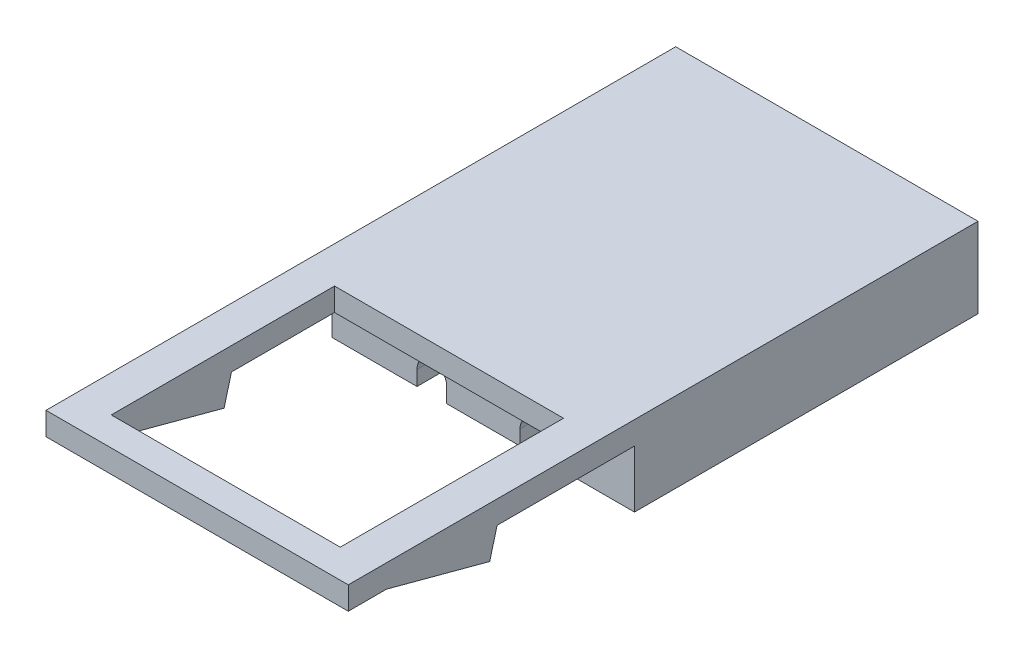
ISO-10303-21;
HEADER;
FILE_DESCRIPTION(('STEP AP214'),'2;1');
FILE_NAME('part.step','',(''),(''),'','','');
FILE_SCHEMA(('AUTOMOTIVE_DESIGN { 1 0 10303 214 1 1 1 1 }'));
ENDSEC;
DATA;
#1=APPLICATION_CONTEXT('core data for automotive mechanical design processes');
#2=APPLICATION_PROTOCOL_DEFINITION('international standard','automotive_design',2000,#1);
#3=PRODUCT_CONTEXT('',#1,'mechanical');
#4=PRODUCT('Part','Part','',(#3));
#5=PRODUCT_RELATED_PRODUCT_CATEGORY('part','',(#4));
#6=PRODUCT_DEFINITION_FORMATION('','',#4);
#7=PRODUCT_DEFINITION_CONTEXT('part definition',#1,'design');
#8=PRODUCT_DEFINITION('design','',#6,#7);
#9=PRODUCT_DEFINITION_SHAPE('','',#8);
#10=(LENGTH_UNIT() NAMED_UNIT(*) SI_UNIT(.MILLI.,.METRE.));
#11=(NAMED_UNIT(*) PLANE_ANGLE_UNIT() SI_UNIT($,.RADIAN.));
#12=(NAMED_UNIT(*) SI_UNIT($,.STERADIAN.) SOLID_ANGLE_UNIT());
#13=UNCERTAINTY_MEASURE_WITH_UNIT(LENGTH_MEASURE(1.E-05),#10,'distance_accuracy_value','');
#14=(GEOMETRIC_REPRESENTATION_CONTEXT(3) GLOBAL_UNCERTAINTY_ASSIGNED_CONTEXT((#13)) GLOBAL_UNIT_ASSIGNED_CONTEXT((#10,
#11,#12)) REPRESENTATION_CONTEXT('',''));
#15=CARTESIAN_POINT('',(0.,0.,0.));
#16=DIRECTION('',(0.,0.,1.));
#17=DIRECTION('',(1.,0.,0.));
#18=AXIS2_PLACEMENT_3D('',#15,#16,#17);
#19=CARTESIAN_POINT('',(-13.2,5.,-35.));
#20=DIRECTION('',(0.,-1.,0.));
#21=DIRECTION('',(0.,0.,-1.));
#22=AXIS2_PLACEMENT_3D('',#19,#20,#21);
#23=PLANE('',#22);
#24=DIRECTION('',(1.,0.,0.));
#25=VECTOR('',#24,1.);
#26=CARTESIAN_POINT('',(13.2,5.,-28.));
#27=LINE('',#26,#25);
#28=CARTESIAN_POINT('',(5.8,5.,-28.));
#29=VERTEX_POINT('',#28);
#30=CARTESIAN_POINT('',(13.2,5.,-28.));
#31=VERTEX_POINT('',#30);
#32=EDGE_CURVE('E213',#29,#31,#27,.T.);
#33=ORIENTED_EDGE('',*,*,#32,.T.);
#34=DIRECTION('',(0.,0.,1.));
#35=VECTOR('',#34,1.);
#36=CARTESIAN_POINT('',(13.2,5.,0.));
#37=LINE('',#36,#35);
#38=CARTESIAN_POINT('',(13.2,5.,2.));
#39=VERTEX_POINT('',#38);
#40=EDGE_CURVE('E238',#31,#39,#37,.T.);
#41=ORIENTED_EDGE('',*,*,#40,.T.);
#42=DIRECTION('',(1.,0.,0.));
#43=VECTOR('',#42,1.);
#44=CARTESIAN_POINT('',(-13.2,5.,2.));
#45=LINE('',#44,#43);
#46=CARTESIAN_POINT('',(5.8,5.,2.));
#47=VERTEX_POINT('',#46);
#48=EDGE_CURVE('E299',#47,#39,#45,.T.);
#49=ORIENTED_EDGE('',*,*,#48,.F.);
#50=DIRECTION('',(0.,0.,1.));
#51=VECTOR('',#50,1.);
#52=CARTESIAN_POINT('',(5.8,5.,0.));
#53=LINE('',#52,#51);
#54=EDGE_CURVE('E227',#29,#47,#53,.T.);
#55=ORIENTED_EDGE('',*,*,#54,.F.);
#56=EDGE_LOOP('',(#33,#41,#49,#55));
#57=FACE_BOUND('',#56,.T.);
#58=ADVANCED_FACE('F34',(#57),#23,.T.);
#59=CARTESIAN_POINT('',(-13.2,5.,-28.));
#60=VERTEX_POINT('',#59);
#61=CARTESIAN_POINT('',(-5.8,5.,-28.));
#62=VERTEX_POINT('',#61);
#63=EDGE_CURVE('E279',#60,#62,#27,.T.);
#64=ORIENTED_EDGE('',*,*,#63,.T.);
#65=DIRECTION('',(0.,0.,-1.));
#66=VECTOR('',#65,1.);
#67=CARTESIAN_POINT('',(-5.8,5.,0.));
#68=LINE('',#67,#66);
#69=CARTESIAN_POINT('',(-5.8,5.,2.));
#70=VERTEX_POINT('',#69);
#71=EDGE_CURVE('E223',#70,#62,#68,.T.);
#72=ORIENTED_EDGE('',*,*,#71,.F.);
#73=CARTESIAN_POINT('',(-13.2,5.,2.));
#74=VERTEX_POINT('',#73);
#75=EDGE_CURVE('E304',#74,#70,#45,.T.);
#76=ORIENTED_EDGE('',*,*,#75,.F.);
#77=DIRECTION('',(0.,0.,-1.));
#78=VECTOR('',#77,1.);
#79=CARTESIAN_POINT('',(-13.2,5.,0.));
#80=LINE('',#79,#78);
#81=EDGE_CURVE('E235',#74,#60,#80,.T.);
#82=ORIENTED_EDGE('',*,*,#81,.T.);
#83=EDGE_LOOP('',(#64,#72,#76,#82));
#84=FACE_BOUND('',#83,.T.);
#85=ADVANCED_FACE('F422',(#84),#23,.T.);
#86=CARTESIAN_POINT('',(-3.2,5.,-28.));
#87=VERTEX_POINT('',#86);
#88=CARTESIAN_POINT('',(3.2,5.,-28.));
#89=VERTEX_POINT('',#88);
#90=EDGE_CURVE('E276',#87,#89,#27,.T.);
#91=ORIENTED_EDGE('',*,*,#90,.T.);
#92=DIRECTION('',(0.,0.,-1.));
#93=VECTOR('',#92,1.);
#94=CARTESIAN_POINT('',(3.2,5.,0.));
#95=LINE('',#94,#93);
#96=CARTESIAN_POINT('',(3.2,5.,2.));
#97=VERTEX_POINT('',#96);
#98=EDGE_CURVE('E245',#97,#89,#95,.T.);
#99=ORIENTED_EDGE('',*,*,#98,.F.);
#100=CARTESIAN_POINT('',(-3.2,5.,2.));
#101=VERTEX_POINT('',#100);
#102=EDGE_CURVE('E275',#101,#97,#45,.T.);
#103=ORIENTED_EDGE('',*,*,#102,.F.);
#104=DIRECTION('',(0.,0.,1.));
#105=VECTOR('',#104,1.);
#106=CARTESIAN_POINT('',(-3.2,5.,0.));
#107=LINE('',#106,#105);
#108=EDGE_CURVE('E38',#87,#101,#107,.T.);
#109=ORIENTED_EDGE('',*,*,#108,.F.);
#110=EDGE_LOOP('',(#91,#99,#103,#109));
#111=FACE_BOUND('',#110,.T.);
#112=ADVANCED_FACE('F273',(#111),#23,.T.);
#113=CARTESIAN_POINT('',(-31.75,12.,0.));
#114=DIRECTION('',(0.,1.,0.));
#115=DIRECTION('',(0.,0.,1.));
#116=AXIS2_PLACEMENT_3D('',#113,#114,#115);
#117=PLANE('',#116);
#118=DIRECTION('',(1.,0.,0.));
#119=VECTOR('',#118,1.);
#120=CARTESIAN_POINT('',(13.2,12.,-28.));
#121=LINE('',#120,#119);
#122=CARTESIAN_POINT('',(-13.2,12.,-28.));
#123=VERTEX_POINT('',#122);
#124=CARTESIAN_POINT('',(13.2,12.,-28.));
#125=VERTEX_POINT('',#124);
#126=EDGE_CURVE('E52',#123,#125,#121,.T.);
#127=ORIENTED_EDGE('',*,*,#126,.F.);
#128=DIRECTION('',(0.,0.,1.));
#129=VECTOR('',#128,1.);
#130=CARTESIAN_POINT('',(-13.2,12.,-35.));
#131=LINE('',#130,#129);
#132=CARTESIAN_POINT('',(-13.2,12.,27.));
#133=VERTEX_POINT('',#132);
#134=EDGE_CURVE('E246',#123,#133,#131,.T.);
#135=ORIENTED_EDGE('',*,*,#134,.T.);
#136=DIRECTION('',(-1.,0.,0.));
#137=VECTOR('',#136,1.);
#138=CARTESIAN_POINT('',(13.20005,12.,27.));
#139=LINE('',#138,#137);
#140=CARTESIAN_POINT('',(13.2,12.,27.));
#141=VERTEX_POINT('',#140);
#142=EDGE_CURVE('E371',#141,#133,#139,.T.);
#143=ORIENTED_EDGE('',*,*,#142,.F.);
#144=DIRECTION('',(0.,0.,-1.));
#145=VECTOR('',#144,1.);
#146=CARTESIAN_POINT('',(13.2,12.,0.));
#147=LINE('',#146,#145);
#148=EDGE_CURVE('E249',#141,#125,#147,.T.);
#149=ORIENTED_EDGE('',*,*,#148,.T.);
#150=EDGE_LOOP('',(#127,#135,#143,#149));
#151=FACE_BOUND('',#150,.T.);
#152=DIRECTION('',(1.,0.,0.));
#153=VECTOR('',#152,1.);
#154=CARTESIAN_POINT('',(10.,12.,24.5));
#155=LINE('',#154,#153);
#156=CARTESIAN_POINT('',(-10.,12.,24.5));
#157=VERTEX_POINT('',#156);
#158=CARTESIAN_POINT('',(10.,12.,24.5));
#159=VERTEX_POINT('',#158);
#160=EDGE_CURVE('E377',#157,#159,#155,.T.);
#161=ORIENTED_EDGE('',*,*,#160,.F.);
#162=DIRECTION('',(0.,0.,1.));
#163=VECTOR('',#162,1.);
#164=CARTESIAN_POINT('',(-10.,12.,5.));
#165=LINE('',#164,#163);
#166=CARTESIAN_POINT('',(-10.,12.,5.));
#167=VERTEX_POINT('',#166);
#168=EDGE_CURVE('E374',#167,#157,#165,.T.);
#169=ORIENTED_EDGE('',*,*,#168,.F.);
#170=DIRECTION('',(-1.,0.,0.));
#171=VECTOR('',#170,1.);
#172=CARTESIAN_POINT('',(10.,12.,5.));
#173=LINE('',#172,#171);
#174=CARTESIAN_POINT('',(10.,12.,5.));
#175=VERTEX_POINT('',#174);
#176=EDGE_CURVE('E240',#175,#167,#173,.T.);
#177=ORIENTED_EDGE('',*,*,#176,.F.);
#178=DIRECTION('',(0.,0.,-1.));
#179=VECTOR('',#178,1.);
#180=CARTESIAN_POINT('',(10.,12.,5.));
#181=LINE('',#180,#179);
#182=EDGE_CURVE('E380',#159,#175,#181,.T.);
#183=ORIENTED_EDGE('',*,*,#182,.F.);
#184=EDGE_LOOP('',(#161,#169,#177,#183));
#185=FACE_BOUND('',#184,.T.);
#186=ADVANCED_FACE('F36',(#151,#185),#117,.T.);
#187=CARTESIAN_POINT('',(-5.8,6.3,0.));
#188=DIRECTION('',(-1.,0.,0.));
#189=DIRECTION('',(0.,0.,1.));
#190=AXIS2_PLACEMENT_3D('',#187,#188,#189);
#191=PLANE('',#190);
#192=ORIENTED_EDGE('',*,*,#71,.T.);
#193=DIRECTION('',(0.,1.,0.));
#194=VECTOR('',#193,1.);
#195=CARTESIAN_POINT('',(-5.8,6.3,-28.));
#196=LINE('',#195,#194);
#197=CARTESIAN_POINT('',(-5.8,6.3,-28.));
#198=VERTEX_POINT('',#197);
#199=EDGE_CURVE('E296',#62,#198,#196,.T.);
#200=ORIENTED_EDGE('',*,*,#199,.T.);
#201=DIRECTION('',(0.,0.,-1.));
#202=VECTOR('',#201,1.);
#203=CARTESIAN_POINT('',(-5.8,6.3,0.));
#204=LINE('',#203,#202);
#205=CARTESIAN_POINT('',(-5.8,6.3,2.));
#206=VERTEX_POINT('',#205);
#207=EDGE_CURVE('E231',#206,#198,#204,.T.);
#208=ORIENTED_EDGE('',*,*,#207,.F.);
#209=DIRECTION('',(0.,-1.,0.));
#210=VECTOR('',#209,1.);
#211=CARTESIAN_POINT('',(-5.8,6.3,2.));
#212=LINE('',#211,#210);
#213=EDGE_CURVE('E315',#206,#70,#212,.T.);
#214=ORIENTED_EDGE('',*,*,#213,.T.);
#215=EDGE_LOOP('',(#192,#200,#208,#214));
#216=FACE_BOUND('',#215,.T.);
#217=ADVANCED_FACE('F433',(#216),#191,.F.);
#218=CARTESIAN_POINT('',(-3.2,6.3,0.));
#219=DIRECTION('',(1.,0.,0.));
#220=DIRECTION('',(0.,0.,-1.));
#221=AXIS2_PLACEMENT_3D('',#218,#219,#220);
#222=PLANE('',#221);
#223=DIRECTION('',(0.,0.,1.));
#224=VECTOR('',#223,1.);
#225=CARTESIAN_POINT('',(-3.2,6.3,0.));
#226=LINE('',#225,#224);
#227=CARTESIAN_POINT('',(-3.2,6.3,-28.));
#228=VERTEX_POINT('',#227);
#229=CARTESIAN_POINT('',(-3.2,6.3,2.));
#230=VERTEX_POINT('',#229);
#231=EDGE_CURVE('E233',#228,#230,#226,.T.);
#232=ORIENTED_EDGE('',*,*,#231,.F.);
#233=DIRECTION('',(0.,-1.,0.));
#234=VECTOR('',#233,1.);
#235=CARTESIAN_POINT('',(-3.2,6.3,-28.));
#236=LINE('',#235,#234);
#237=EDGE_CURVE('E294',#228,#87,#236,.T.);
#238=ORIENTED_EDGE('',*,*,#237,.T.);
#239=ORIENTED_EDGE('',*,*,#108,.T.);
#240=DIRECTION('',(0.,1.,0.));
#241=VECTOR('',#240,1.);
#242=CARTESIAN_POINT('',(-3.2,6.3,2.));
#243=LINE('',#242,#241);
#244=EDGE_CURVE('E312',#101,#230,#243,.T.);
#245=ORIENTED_EDGE('',*,*,#244,.T.);
#246=EDGE_LOOP('',(#232,#238,#239,#245));
#247=FACE_BOUND('',#246,.T.);
#248=ADVANCED_FACE('F438',(#247),#222,.F.);
#249=CARTESIAN_POINT('',(3.2,6.3,0.));
#250=DIRECTION('',(-1.,0.,0.));
#251=DIRECTION('',(0.,0.,1.));
#252=AXIS2_PLACEMENT_3D('',#249,#250,#251);
#253=PLANE('',#252);
#254=ORIENTED_EDGE('',*,*,#98,.T.);
#255=DIRECTION('',(0.,1.,0.));
#256=VECTOR('',#255,1.);
#257=CARTESIAN_POINT('',(3.2,6.3,-28.));
#258=LINE('',#257,#256);
#259=CARTESIAN_POINT('',(3.2,6.3,-28.));
#260=VERTEX_POINT('',#259);
#261=EDGE_CURVE('E216',#89,#260,#258,.T.);
#262=ORIENTED_EDGE('',*,*,#261,.T.);
#263=DIRECTION('',(0.,0.,-1.));
#264=VECTOR('',#263,1.);
#265=CARTESIAN_POINT('',(3.2,6.3,0.));
#266=LINE('',#265,#264);
#267=CARTESIAN_POINT('',(3.2,6.3,2.));
#268=VERTEX_POINT('',#267);
#269=EDGE_CURVE('E205',#268,#260,#266,.T.);
#270=ORIENTED_EDGE('',*,*,#269,.F.);
#271=DIRECTION('',(0.,-1.,0.));
#272=VECTOR('',#271,1.);
#273=CARTESIAN_POINT('',(3.2,6.3,2.));
#274=LINE('',#273,#272);
#275=EDGE_CURVE('E269',#268,#97,#274,.T.);
#276=ORIENTED_EDGE('',*,*,#275,.T.);
#277=EDGE_LOOP('',(#254,#262,#270,#276));
#278=FACE_BOUND('',#277,.T.);
#279=ADVANCED_FACE('F267',(#278),#253,.F.);
#280=CARTESIAN_POINT('',(5.8,6.3,0.));
#281=DIRECTION('',(1.,0.,0.));
#282=DIRECTION('',(0.,0.,-1.));
#283=AXIS2_PLACEMENT_3D('',#280,#281,#282);
#284=PLANE('',#283);
#285=DIRECTION('',(0.,0.,1.));
#286=VECTOR('',#285,1.);
#287=CARTESIAN_POINT('',(5.8,6.3,0.));
#288=LINE('',#287,#286);
#289=CARTESIAN_POINT('',(5.8,6.3,-28.));
#290=VERTEX_POINT('',#289);
#291=CARTESIAN_POINT('',(5.8,6.3,2.));
#292=VERTEX_POINT('',#291);
#293=EDGE_CURVE('E202',#290,#292,#288,.T.);
#294=ORIENTED_EDGE('',*,*,#293,.F.);
#295=DIRECTION('',(0.,-1.,0.));
#296=VECTOR('',#295,1.);
#297=CARTESIAN_POINT('',(5.8,6.3,-28.));
#298=LINE('',#297,#296);
#299=EDGE_CURVE('E210',#290,#29,#298,.T.);
#300=ORIENTED_EDGE('',*,*,#299,.T.);
#301=ORIENTED_EDGE('',*,*,#54,.T.);
#302=DIRECTION('',(0.,1.,0.));
#303=VECTOR('',#302,1.);
#304=CARTESIAN_POINT('',(5.8,6.3,2.));
#305=LINE('',#304,#303);
#306=EDGE_CURVE('E222',#47,#292,#305,.T.);
#307=ORIENTED_EDGE('',*,*,#306,.T.);
#308=EDGE_LOOP('',(#294,#300,#301,#307));
#309=FACE_BOUND('',#308,.T.);
#310=ADVANCED_FACE('F220',(#309),#284,.F.);
#311=CARTESIAN_POINT('',(-13.2,12.,-35.));
#312=DIRECTION('',(1.,0.,0.));
#313=DIRECTION('',(0.,0.,-1.));
#314=AXIS2_PLACEMENT_3D('',#311,#312,#313);
#315=PLANE('',#314);
#316=ORIENTED_EDGE('',*,*,#134,.F.);
#317=DIRECTION('',(0.,1.,0.));
#318=VECTOR('',#317,1.);
#319=CARTESIAN_POINT('',(-13.2,5.,-28.));
#320=LINE('',#319,#318);
#321=EDGE_CURVE('E282',#60,#123,#320,.T.);
#322=ORIENTED_EDGE('',*,*,#321,.F.);
#323=ORIENTED_EDGE('',*,*,#81,.F.);
#324=DIRECTION('',(0.,-1.,0.));
#325=VECTOR('',#324,1.);
#326=CARTESIAN_POINT('',(-13.2,10.,2.));
#327=LINE('',#326,#325);
#328=CARTESIAN_POINT('',(-13.2,10.,2.));
#329=VERTEX_POINT('',#328);
#330=EDGE_CURVE('E303',#329,#74,#327,.T.);
#331=ORIENTED_EDGE('',*,*,#330,.F.);
#332=DIRECTION('',(0.,0.,-1.));
#333=VECTOR('',#332,1.);
#334=CARTESIAN_POINT('',(-13.2,10.,4.));
#335=LINE('',#334,#333);
#336=CARTESIAN_POINT('',(-13.2,10.,14.));
#337=VERTEX_POINT('',#336);
#338=EDGE_CURVE('E359',#337,#329,#335,.T.);
#339=ORIENTED_EDGE('',*,*,#338,.F.);
#340=DIRECTION('',(0.,0.965925826289069,-0.258819045102519));
#341=VECTOR('',#340,1.);
#342=CARTESIAN_POINT('',(-13.2,10.,14.));
#343=LINE('',#342,#341);
#344=CARTESIAN_POINT('',(-13.2,7.58518543427733,14.6470476127563));
#345=VERTEX_POINT('',#344);
#346=EDGE_CURVE('E323',#345,#337,#343,.T.);
#347=ORIENTED_EDGE('',*,*,#346,.F.);
#348=DIRECTION('',(0.,-0.258817926764706,-0.965926125946089));
#349=VECTOR('',#348,1.);
#350=CARTESIAN_POINT('',(-13.2,7.58518543427733,14.6470476127563));
#351=LINE('',#350,#349);
#352=CARTESIAN_POINT('',(-13.2,10.,23.6593));
#353=VERTEX_POINT('',#352);
#354=EDGE_CURVE('E318',#353,#345,#351,.T.);
#355=ORIENTED_EDGE('',*,*,#354,.F.);
#356=DIRECTION('',(0.,0.,-1.));
#357=VECTOR('',#356,1.);
#358=CARTESIAN_POINT('',(-13.2,10.,27.));
#359=LINE('',#358,#357);
#360=CARTESIAN_POINT('',(-13.2,10.,27.));
#361=VERTEX_POINT('',#360);
#362=EDGE_CURVE('E351',#361,#353,#359,.T.);
#363=ORIENTED_EDGE('',*,*,#362,.F.);
#364=DIRECTION('',(0.,-1.,0.));
#365=VECTOR('',#364,1.);
#366=CARTESIAN_POINT('',(-13.2,5.,27.));
#367=LINE('',#366,#365);
#368=EDGE_CURVE('E386',#133,#361,#367,.T.);
#369=ORIENTED_EDGE('',*,*,#368,.F.);
#370=EDGE_LOOP('',(#316,#322,#323,#331,#339,#347,#355,#363,#369));
#371=FACE_BOUND('',#370,.T.);
#372=ADVANCED_FACE('F478',(#371),#315,.F.);
#373=CARTESIAN_POINT('',(13.2,12.,0.));
#374=DIRECTION('',(-1.,0.,0.));
#375=DIRECTION('',(0.,0.,1.));
#376=AXIS2_PLACEMENT_3D('',#373,#374,#375);
#377=PLANE('',#376);
#378=ORIENTED_EDGE('',*,*,#40,.F.);
#379=DIRECTION('',(0.,1.,0.));
#380=VECTOR('',#379,1.);
#381=CARTESIAN_POINT('',(13.2,5.,-28.));
#382=LINE('',#381,#380);
#383=EDGE_CURVE('E288',#31,#125,#382,.T.);
#384=ORIENTED_EDGE('',*,*,#383,.T.);
#385=ORIENTED_EDGE('',*,*,#148,.F.);
#386=DIRECTION('',(0.,1.,0.));
#387=VECTOR('',#386,1.);
#388=CARTESIAN_POINT('',(13.2,5.,27.));
#389=LINE('',#388,#387);
#390=CARTESIAN_POINT('',(13.2,10.,27.));
#391=VERTEX_POINT('',#390);
#392=EDGE_CURVE('E394',#391,#141,#389,.T.);
#393=ORIENTED_EDGE('',*,*,#392,.F.);
#394=DIRECTION('',(0.,0.,-1.));
#395=VECTOR('',#394,1.);
#396=CARTESIAN_POINT('',(13.2,10.,27.));
#397=LINE('',#396,#395);
#398=CARTESIAN_POINT('',(13.2,10.,23.6593));
#399=VERTEX_POINT('',#398);
#400=EDGE_CURVE('E352',#391,#399,#397,.T.);
#401=ORIENTED_EDGE('',*,*,#400,.T.);
#402=DIRECTION('',(0.,-0.258817926764706,-0.965926125946089));
#403=VECTOR('',#402,1.);
#404=CARTESIAN_POINT('',(13.2,7.58518543427733,14.6470476127563));
#405=LINE('',#404,#403);
#406=CARTESIAN_POINT('',(13.2,7.58518543427733,14.6470476127563));
#407=VERTEX_POINT('',#406);
#408=EDGE_CURVE('E319',#399,#407,#405,.T.);
#409=ORIENTED_EDGE('',*,*,#408,.T.);
#410=DIRECTION('',(0.,0.965925826289069,-0.258819045102519));
#411=VECTOR('',#410,1.);
#412=CARTESIAN_POINT('',(13.2,10.,14.));
#413=LINE('',#412,#411);
#414=CARTESIAN_POINT('',(13.2,10.,14.));
#415=VERTEX_POINT('',#414);
#416=EDGE_CURVE('E322',#407,#415,#413,.T.);
#417=ORIENTED_EDGE('',*,*,#416,.T.);
#418=DIRECTION('',(0.,0.,-1.));
#419=VECTOR('',#418,1.);
#420=CARTESIAN_POINT('',(13.2,10.,4.));
#421=LINE('',#420,#419);
#422=CARTESIAN_POINT('',(13.2,10.,2.));
#423=VERTEX_POINT('',#422);
#424=EDGE_CURVE('E361',#415,#423,#421,.T.);
#425=ORIENTED_EDGE('',*,*,#424,.T.);
#426=DIRECTION('',(0.,-1.,0.));
#427=VECTOR('',#426,1.);
#428=CARTESIAN_POINT('',(13.2,10.,2.));
#429=LINE('',#428,#427);
#430=EDGE_CURVE('E306',#423,#39,#429,.T.);
#431=ORIENTED_EDGE('',*,*,#430,.T.);
#432=EDGE_LOOP('',(#378,#384,#385,#393,#401,#409,#417,#425,#431));
#433=FACE_BOUND('',#432,.T.);
#434=ADVANCED_FACE('F499',(#433),#377,.F.);
#435=CARTESIAN_POINT('',(-13.2,15.,27.));
#436=DIRECTION('',(0.,0.,-1.));
#437=DIRECTION('',(-1.,0.,0.));
#438=AXIS2_PLACEMENT_3D('',#435,#436,#437);
#439=PLANE('',#438);
#440=ORIENTED_EDGE('',*,*,#368,.T.);
#441=DIRECTION('',(-1.,0.,0.));
#442=VECTOR('',#441,1.);
#443=CARTESIAN_POINT('',(13.2,10.,27.));
#444=LINE('',#443,#442);
#445=EDGE_CURVE('E354',#391,#361,#444,.T.);
#446=ORIENTED_EDGE('',*,*,#445,.F.);
#447=ORIENTED_EDGE('',*,*,#392,.T.);
#448=ORIENTED_EDGE('',*,*,#142,.T.);
#449=EDGE_LOOP('',(#440,#446,#447,#448));
#450=FACE_BOUND('',#449,.T.);
#451=ADVANCED_FACE('F511',(#450),#439,.F.);
#452=CARTESIAN_POINT('',(10.,4.99995,5.));
#453=DIRECTION('',(1.,0.,0.));
#454=DIRECTION('',(0.,0.,-1.));
#455=AXIS2_PLACEMENT_3D('',#452,#453,#454);
#456=PLANE('',#455);
#457=DIRECTION('',(0.,0.,1.));
#458=VECTOR('',#457,1.);
#459=CARTESIAN_POINT('',(10.,10.,5.));
#460=LINE('',#459,#458);
#461=CARTESIAN_POINT('',(10.,10.,5.));
#462=VERTEX_POINT('',#461);
#463=CARTESIAN_POINT('',(10.,10.,14.));
#464=VERTEX_POINT('',#463);
#465=EDGE_CURVE('E60',#462,#464,#460,.T.);
#466=ORIENTED_EDGE('',*,*,#465,.T.);
#467=DIRECTION('',(0.,-0.965925826289069,0.258819045102519));
#468=VECTOR('',#467,1.);
#469=CARTESIAN_POINT('',(10.,7.58488983990379,14.64712681703));
#470=LINE('',#469,#468);
#471=CARTESIAN_POINT('',(10.,7.58518543427733,14.6470476127563));
#472=VERTEX_POINT('',#471);
#473=EDGE_CURVE('E345',#464,#472,#470,.T.);
#474=ORIENTED_EDGE('',*,*,#473,.T.);
#475=DIRECTION('',(0.,0.258817926764706,0.965926125946089));
#476=VECTOR('',#475,1.);
#477=CARTESIAN_POINT('',(10.,5.00025676379945,4.99991780326833));
#478=LINE('',#477,#476);
#479=CARTESIAN_POINT('',(10.,10.,23.6593));
#480=VERTEX_POINT('',#479);
#481=EDGE_CURVE('E348',#472,#480,#478,.T.);
#482=ORIENTED_EDGE('',*,*,#481,.T.);
#483=DIRECTION('',(0.,0.,1.));
#484=VECTOR('',#483,1.);
#485=CARTESIAN_POINT('',(10.,10.,5.));
#486=LINE('',#485,#484);
#487=CARTESIAN_POINT('',(10.,10.,24.5));
#488=VERTEX_POINT('',#487);
#489=EDGE_CURVE('E340',#480,#488,#486,.T.);
#490=ORIENTED_EDGE('',*,*,#489,.T.);
#491=DIRECTION('',(0.,1.,0.));
#492=VECTOR('',#491,1.);
#493=CARTESIAN_POINT('',(10.,4.99995,24.5));
#494=LINE('',#493,#492);
#495=EDGE_CURVE('E384',#488,#159,#494,.T.);
#496=ORIENTED_EDGE('',*,*,#495,.T.);
#497=ORIENTED_EDGE('',*,*,#182,.T.);
#498=DIRECTION('',(0.,1.,0.));
#499=VECTOR('',#498,1.);
#500=CARTESIAN_POINT('',(10.,4.99995,5.));
#501=LINE('',#500,#499);
#502=EDGE_CURVE('E383',#462,#175,#501,.T.);
#503=ORIENTED_EDGE('',*,*,#502,.F.);
#504=EDGE_LOOP('',(#466,#474,#482,#490,#496,#497,#503));
#505=FACE_BOUND('',#504,.T.);
#506=ADVANCED_FACE('F457',(#505),#456,.F.);
#507=CARTESIAN_POINT('',(10.,4.99995,24.5));
#508=DIRECTION('',(0.,0.,1.));
#509=DIRECTION('',(1.,0.,0.));
#510=AXIS2_PLACEMENT_3D('',#507,#508,#509);
#511=PLANE('',#510);
#512=ORIENTED_EDGE('',*,*,#495,.F.);
#513=DIRECTION('',(-1.,0.,0.));
#514=VECTOR('',#513,1.);
#515=CARTESIAN_POINT('',(13.2,10.,24.5));
#516=LINE('',#515,#514);
#517=CARTESIAN_POINT('',(-10.,10.,24.5));
#518=VERTEX_POINT('',#517);
#519=EDGE_CURVE('E356',#488,#518,#516,.T.);
#520=ORIENTED_EDGE('',*,*,#519,.T.);
#521=DIRECTION('',(0.,1.,0.));
#522=VECTOR('',#521,1.);
#523=CARTESIAN_POINT('',(-10.,4.99995,24.5));
#524=LINE('',#523,#522);
#525=EDGE_CURVE('E387',#518,#157,#524,.T.);
#526=ORIENTED_EDGE('',*,*,#525,.T.);
#527=ORIENTED_EDGE('',*,*,#160,.T.);
#528=EDGE_LOOP('',(#512,#520,#526,#527));
#529=FACE_BOUND('',#528,.T.);
#530=ADVANCED_FACE('F459',(#529),#511,.F.);
#531=CARTESIAN_POINT('',(-10.,4.99995,5.));
#532=DIRECTION('',(-1.,0.,0.));
#533=DIRECTION('',(0.,0.,1.));
#534=AXIS2_PLACEMENT_3D('',#531,#532,#533);
#535=PLANE('',#534);
#536=DIRECTION('',(0.,-0.258817926764706,-0.965926125946089));
#537=VECTOR('',#536,1.);
#538=CARTESIAN_POINT('',(-10.,5.00025676379945,4.99991780326834));
#539=LINE('',#538,#537);
#540=CARTESIAN_POINT('',(-10.,10.,23.6593));
#541=VERTEX_POINT('',#540);
#542=CARTESIAN_POINT('',(-10.,7.58518543427733,14.6470476127563));
#543=VERTEX_POINT('',#542);
#544=EDGE_CURVE('E11',#541,#543,#539,.T.);
#545=ORIENTED_EDGE('',*,*,#544,.T.);
#546=DIRECTION('',(0.,0.965925826289069,-0.258819045102519));
#547=VECTOR('',#546,1.);
#548=CARTESIAN_POINT('',(-10.,7.58488983990378,14.64712681703));
#549=LINE('',#548,#547);
#550=CARTESIAN_POINT('',(-10.,10.,14.));
#551=VERTEX_POINT('',#550);
#552=EDGE_CURVE('E342',#543,#551,#549,.T.);
#553=ORIENTED_EDGE('',*,*,#552,.T.);
#554=DIRECTION('',(0.,0.,-1.));
#555=VECTOR('',#554,1.);
#556=CARTESIAN_POINT('',(-10.,10.,5.));
#557=LINE('',#556,#555);
#558=CARTESIAN_POINT('',(-10.,10.,5.));
#559=VERTEX_POINT('',#558);
#560=EDGE_CURVE('E367',#551,#559,#557,.T.);
#561=ORIENTED_EDGE('',*,*,#560,.T.);
#562=DIRECTION('',(0.,1.,0.));
#563=VECTOR('',#562,1.);
#564=CARTESIAN_POINT('',(-10.,4.99995,5.));
#565=LINE('',#564,#563);
#566=EDGE_CURVE('E389',#559,#167,#565,.T.);
#567=ORIENTED_EDGE('',*,*,#566,.T.);
#568=ORIENTED_EDGE('',*,*,#168,.T.);
#569=ORIENTED_EDGE('',*,*,#525,.F.);
#570=DIRECTION('',(0.,0.,-1.));
#571=VECTOR('',#570,1.);
#572=CARTESIAN_POINT('',(-10.,10.,5.));
#573=LINE('',#572,#571);
#574=EDGE_CURVE('E333',#518,#541,#573,.T.);
#575=ORIENTED_EDGE('',*,*,#574,.T.);
#576=EDGE_LOOP('',(#545,#553,#561,#567,#568,#569,#575));
#577=FACE_BOUND('',#576,.T.);
#578=ADVANCED_FACE('F450',(#577),#535,.F.);
#579=CARTESIAN_POINT('',(10.,4.99995,5.));
#580=DIRECTION('',(0.,0.,-1.));
#581=DIRECTION('',(-1.,0.,0.));
#582=AXIS2_PLACEMENT_3D('',#579,#580,#581);
#583=PLANE('',#582);
#584=ORIENTED_EDGE('',*,*,#566,.F.);
#585=DIRECTION('',(1.,0.,0.));
#586=VECTOR('',#585,1.);
#587=CARTESIAN_POINT('',(10.,10.,5.));
#588=LINE('',#587,#586);
#589=EDGE_CURVE('E44',#559,#462,#588,.T.);
#590=ORIENTED_EDGE('',*,*,#589,.T.);
#591=ORIENTED_EDGE('',*,*,#502,.T.);
#592=ORIENTED_EDGE('',*,*,#176,.T.);
#593=EDGE_LOOP('',(#584,#590,#591,#592));
#594=FACE_BOUND('',#593,.T.);
#595=ADVANCED_FACE('F454',(#594),#583,.F.);
#596=CARTESIAN_POINT('',(13.2,10.,4.));
#597=DIRECTION('',(0.,1.,0.));
#598=DIRECTION('',(0.,0.,1.));
#599=AXIS2_PLACEMENT_3D('',#596,#597,#598);
#600=PLANE('',#599);
#601=ORIENTED_EDGE('',*,*,#589,.F.);
#602=ORIENTED_EDGE('',*,*,#560,.F.);
#603=DIRECTION('',(-1.,0.,0.));
#604=VECTOR('',#603,1.);
#605=CARTESIAN_POINT('',(13.2,10.,14.));
#606=LINE('',#605,#604);
#607=EDGE_CURVE('E363',#551,#337,#606,.T.);
#608=ORIENTED_EDGE('',*,*,#607,.T.);
#609=ORIENTED_EDGE('',*,*,#338,.T.);
#610=DIRECTION('',(1.,0.,0.));
#611=VECTOR('',#610,1.);
#612=CARTESIAN_POINT('',(-13.2,10.,2.));
#613=LINE('',#612,#611);
#614=EDGE_CURVE('E300',#329,#423,#613,.T.);
#615=ORIENTED_EDGE('',*,*,#614,.T.);
#616=ORIENTED_EDGE('',*,*,#424,.F.);
#617=EDGE_CURVE('E365',#415,#464,#606,.T.);
#618=ORIENTED_EDGE('',*,*,#617,.T.);
#619=ORIENTED_EDGE('',*,*,#465,.F.);
#620=EDGE_LOOP('',(#601,#602,#608,#609,#615,#616,#618,#619));
#621=FACE_BOUND('',#620,.T.);
#622=ADVANCED_FACE('F474',(#621),#600,.F.);
#623=CARTESIAN_POINT('',(13.2,10.,27.));
#624=DIRECTION('',(0.,1.,0.));
#625=DIRECTION('',(0.,0.,1.));
#626=AXIS2_PLACEMENT_3D('',#623,#624,#625);
#627=PLANE('',#626);
#628=ORIENTED_EDGE('',*,*,#362,.T.);
#629=DIRECTION('',(-1.,0.,0.));
#630=VECTOR('',#629,1.);
#631=CARTESIAN_POINT('',(13.2,10.,23.6593));
#632=LINE('',#631,#630);
#633=EDGE_CURVE('E326',#541,#353,#632,.T.);
#634=ORIENTED_EDGE('',*,*,#633,.F.);
#635=ORIENTED_EDGE('',*,*,#574,.F.);
#636=ORIENTED_EDGE('',*,*,#519,.F.);
#637=ORIENTED_EDGE('',*,*,#489,.F.);
#638=EDGE_CURVE('E335',#399,#480,#632,.T.);
#639=ORIENTED_EDGE('',*,*,#638,.F.);
#640=ORIENTED_EDGE('',*,*,#400,.F.);
#641=ORIENTED_EDGE('',*,*,#445,.T.);
#642=EDGE_LOOP('',(#628,#634,#635,#636,#637,#639,#640,#641));
#643=FACE_BOUND('',#642,.T.);
#644=ADVANCED_FACE('F461',(#643),#627,.F.);
#645=CARTESIAN_POINT('',(13.2,10.,14.));
#646=DIRECTION('',(0.,0.258819045102519,0.965925826289069));
#647=DIRECTION('',(0.,-0.965925826289069,0.258819045102519));
#648=AXIS2_PLACEMENT_3D('',#645,#646,#647);
#649=PLANE('',#648);
#650=ORIENTED_EDGE('',*,*,#617,.F.);
#651=ORIENTED_EDGE('',*,*,#416,.F.);
#652=DIRECTION('',(-1.,0.,0.));
#653=VECTOR('',#652,1.);
#654=CARTESIAN_POINT('',(13.2,7.58518543427733,14.6470476127563));
#655=LINE('',#654,#653);
#656=EDGE_CURVE('E330',#407,#472,#655,.T.);
#657=ORIENTED_EDGE('',*,*,#656,.T.);
#658=ORIENTED_EDGE('',*,*,#473,.F.);
#659=EDGE_LOOP('',(#650,#651,#657,#658));
#660=FACE_BOUND('',#659,.T.);
#661=ADVANCED_FACE('F503',(#660),#649,.F.);
#662=CARTESIAN_POINT('',(13.2,7.58518543427733,14.6470476127563));
#663=DIRECTION('',(0.,0.965926125946089,-0.258817926764706));
#664=DIRECTION('',(0.,0.258817926764706,0.965926125946089));
#665=AXIS2_PLACEMENT_3D('',#662,#663,#664);
#666=PLANE('',#665);
#667=ORIENTED_EDGE('',*,*,#656,.F.);
#668=ORIENTED_EDGE('',*,*,#408,.F.);
#669=ORIENTED_EDGE('',*,*,#638,.T.);
#670=ORIENTED_EDGE('',*,*,#481,.F.);
#671=EDGE_LOOP('',(#667,#668,#669,#670));
#672=FACE_BOUND('',#671,.T.);
#673=ADVANCED_FACE('F506',(#672),#666,.F.);
#674=ORIENTED_EDGE('',*,*,#633,.T.);
#675=ORIENTED_EDGE('',*,*,#354,.T.);
#676=EDGE_CURVE('E334',#543,#345,#655,.T.);
#677=ORIENTED_EDGE('',*,*,#676,.F.);
#678=ORIENTED_EDGE('',*,*,#544,.F.);
#679=EDGE_LOOP('',(#674,#675,#677,#678));
#680=FACE_BOUND('',#679,.T.);
#681=ADVANCED_FACE('F467',(#680),#666,.F.);
#682=ORIENTED_EDGE('',*,*,#676,.T.);
#683=ORIENTED_EDGE('',*,*,#346,.T.);
#684=ORIENTED_EDGE('',*,*,#607,.F.);
#685=ORIENTED_EDGE('',*,*,#552,.F.);
#686=EDGE_LOOP('',(#682,#683,#684,#685));
#687=FACE_BOUND('',#686,.T.);
#688=ADVANCED_FACE('F471',(#687),#649,.F.);
#689=CARTESIAN_POINT('',(-13.2,10.,2.));
#690=DIRECTION('',(0.,0.,-1.));
#691=DIRECTION('',(-1.,0.,0.));
#692=AXIS2_PLACEMENT_3D('',#689,#690,#691);
#693=PLANE('',#692);
#694=ORIENTED_EDGE('',*,*,#275,.F.);
#695=CARTESIAN_POINT('',(4.5,6.3,2.));
#696=DIRECTION('',(0.,0.,-1.));
#697=DIRECTION('',(-1.,0.,0.));
#698=AXIS2_PLACEMENT_3D('',#695,#696,#697);
#699=CIRCLE('',#698,1.3);
#700=EDGE_CURVE('E207',#268,#292,#699,.T.);
#701=ORIENTED_EDGE('',*,*,#700,.T.);
#702=ORIENTED_EDGE('',*,*,#306,.F.);
#703=ORIENTED_EDGE('',*,*,#48,.T.);
#704=ORIENTED_EDGE('',*,*,#430,.F.);
#705=ORIENTED_EDGE('',*,*,#614,.F.);
#706=ORIENTED_EDGE('',*,*,#330,.T.);
#707=ORIENTED_EDGE('',*,*,#75,.T.);
#708=ORIENTED_EDGE('',*,*,#213,.F.);
#709=CARTESIAN_POINT('',(-4.5,6.3,2.));
#710=DIRECTION('',(0.,0.,-1.));
#711=DIRECTION('',(-1.,0.,0.));
#712=AXIS2_PLACEMENT_3D('',#709,#710,#711);
#713=CIRCLE('',#712,1.3);
#714=EDGE_CURVE('E285',#206,#230,#713,.T.);
#715=ORIENTED_EDGE('',*,*,#714,.T.);
#716=ORIENTED_EDGE('',*,*,#244,.F.);
#717=ORIENTED_EDGE('',*,*,#102,.T.);
#718=EDGE_LOOP('',(#694,#701,#702,#703,#704,#705,#706,#707,#708,#715,#716,#717));
#719=FACE_BOUND('',#718,.T.);
#720=ADVANCED_FACE('F413',(#719),#693,.F.);
#721=CARTESIAN_POINT('',(13.2,5.,-28.));
#722=DIRECTION('',(0.,0.,1.));
#723=DIRECTION('',(1.,0.,0.));
#724=AXIS2_PLACEMENT_3D('',#721,#722,#723);
#725=PLANE('',#724);
#726=CARTESIAN_POINT('',(9.,8.5,-28.));
#727=DIRECTION('',(0.,0.,1.));
#728=DIRECTION('',(1.,0.,0.));
#729=AXIS2_PLACEMENT_3D('',#726,#727,#728);
#730=CIRCLE('',#729,2.5);
#731=CARTESIAN_POINT('',(11.5,8.5,-28.));
#732=VERTEX_POINT('',#731);
#733=EDGE_CURVE('E250',#732,#732,#730,.F.);
#734=ORIENTED_EDGE('',*,*,#733,.F.);
#735=EDGE_LOOP('',(#734));
#736=FACE_BOUND('',#735,.T.);
#737=CARTESIAN_POINT('',(-9.,8.5,-28.));
#738=DIRECTION('',(0.,0.,1.));
#739=DIRECTION('',(1.,0.,0.));
#740=AXIS2_PLACEMENT_3D('',#737,#738,#739);
#741=CIRCLE('',#740,2.5);
#742=CARTESIAN_POINT('',(-6.5,8.5,-28.));
#743=VERTEX_POINT('',#742);
#744=EDGE_CURVE('E217',#743,#743,#741,.F.);
#745=ORIENTED_EDGE('',*,*,#744,.F.);
#746=EDGE_LOOP('',(#745));
#747=FACE_BOUND('',#746,.T.);
#748=ORIENTED_EDGE('',*,*,#299,.F.);
#749=CARTESIAN_POINT('',(4.5,6.3,-28.));
#750=DIRECTION('',(0.,0.,-1.));
#751=DIRECTION('',(-1.,0.,0.));
#752=AXIS2_PLACEMENT_3D('',#749,#750,#751);
#753=CIRCLE('',#752,1.3);
#754=EDGE_CURVE('E198',#260,#290,#753,.T.);
#755=ORIENTED_EDGE('',*,*,#754,.F.);
#756=ORIENTED_EDGE('',*,*,#261,.F.);
#757=ORIENTED_EDGE('',*,*,#90,.F.);
#758=ORIENTED_EDGE('',*,*,#237,.F.);
#759=CARTESIAN_POINT('',(-4.5,6.3,-28.));
#760=DIRECTION('',(0.,0.,-1.));
#761=DIRECTION('',(-1.,0.,0.));
#762=AXIS2_PLACEMENT_3D('',#759,#760,#761);
#763=CIRCLE('',#762,1.3);
#764=EDGE_CURVE('E490',#198,#228,#763,.T.);
#765=ORIENTED_EDGE('',*,*,#764,.F.);
#766=ORIENTED_EDGE('',*,*,#199,.F.);
#767=ORIENTED_EDGE('',*,*,#63,.F.);
#768=ORIENTED_EDGE('',*,*,#321,.T.);
#769=ORIENTED_EDGE('',*,*,#126,.T.);
#770=ORIENTED_EDGE('',*,*,#383,.F.);
#771=ORIENTED_EDGE('',*,*,#32,.F.);
#772=EDGE_LOOP('',(#748,#755,#756,#757,#758,#765,#766,#767,#768,#769,#770,#771));
#773=FACE_BOUND('',#772,.T.);
#774=ADVANCED_FACE('F211',(#736,#747,#773),#725,.F.);
#775=CARTESIAN_POINT('',(-13.2,15.,0.));
#776=DIRECTION('',(0.,0.,-1.));
#777=DIRECTION('',(-1.,0.,0.));
#778=AXIS2_PLACEMENT_3D('',#775,#776,#777);
#779=PLANE('',#778);
#780=CARTESIAN_POINT('',(-9.,8.5,0.));
#781=DIRECTION('',(0.,0.,1.));
#782=DIRECTION('',(1.,0.,0.));
#783=AXIS2_PLACEMENT_3D('',#780,#781,#782);
#784=CIRCLE('',#783,2.5);
#785=CARTESIAN_POINT('',(-6.5,8.5,0.));
#786=VERTEX_POINT('',#785);
#787=EDGE_CURVE('E396',#786,#786,#784,.T.);
#788=ORIENTED_EDGE('',*,*,#787,.F.);
#789=EDGE_LOOP('',(#788));
#790=FACE_BOUND('',#789,.T.);
#791=ADVANCED_FACE('F403',(#790),#779,.T.);
#792=CARTESIAN_POINT('',(-9.,8.5,-35.));
#793=DIRECTION('',(0.,0.,1.));
#794=DIRECTION('',(1.,0.,0.));
#795=AXIS2_PLACEMENT_3D('',#792,#793,#794);
#796=CYLINDRICAL_SURFACE('',#795,2.5);
#797=ORIENTED_EDGE('',*,*,#744,.T.);
#798=EDGE_LOOP('',(#797));
#799=FACE_BOUND('',#798,.T.);
#800=ORIENTED_EDGE('',*,*,#787,.T.);
#801=EDGE_LOOP('',(#800));
#802=FACE_BOUND('',#801,.T.);
#803=ADVANCED_FACE('F401',(#799,#802),#796,.F.);
#804=CARTESIAN_POINT('',(9.,8.5,0.));
#805=DIRECTION('',(0.,0.,1.));
#806=DIRECTION('',(1.,0.,0.));
#807=AXIS2_PLACEMENT_3D('',#804,#805,#806);
#808=CIRCLE('',#807,2.5);
#809=CARTESIAN_POINT('',(11.5,8.5,0.));
#810=VERTEX_POINT('',#809);
#811=EDGE_CURVE('E257',#810,#810,#808,.T.);
#812=ORIENTED_EDGE('',*,*,#811,.F.);
#813=EDGE_LOOP('',(#812));
#814=FACE_BOUND('',#813,.T.);
#815=ADVANCED_FACE('F406',(#814),#779,.T.);
#816=CARTESIAN_POINT('',(9.,8.5,-35.));
#817=DIRECTION('',(0.,0.,1.));
#818=DIRECTION('',(1.,0.,0.));
#819=AXIS2_PLACEMENT_3D('',#816,#817,#818);
#820=CYLINDRICAL_SURFACE('',#819,2.5);
#821=ORIENTED_EDGE('',*,*,#733,.T.);
#822=EDGE_LOOP('',(#821));
#823=FACE_BOUND('',#822,.T.);
#824=ORIENTED_EDGE('',*,*,#811,.T.);
#825=EDGE_LOOP('',(#824));
#826=FACE_BOUND('',#825,.T.);
#827=ADVANCED_FACE('F419',(#823,#826),#820,.F.);
#828=CARTESIAN_POINT('',(-4.5,6.3,27.));
#829=DIRECTION('',(0.,0.,-1.));
#830=DIRECTION('',(-1.,0.,0.));
#831=AXIS2_PLACEMENT_3D('',#828,#829,#830);
#832=CYLINDRICAL_SURFACE('',#831,1.3);
#833=ORIENTED_EDGE('',*,*,#207,.T.);
#834=ORIENTED_EDGE('',*,*,#764,.T.);
#835=ORIENTED_EDGE('',*,*,#231,.T.);
#836=ORIENTED_EDGE('',*,*,#714,.F.);
#837=EDGE_LOOP('',(#833,#834,#835,#836));
#838=FACE_BOUND('',#837,.T.);
#839=ADVANCED_FACE('F539',(#838),#832,.F.);
#840=CARTESIAN_POINT('',(4.5,6.3,27.));
#841=DIRECTION('',(0.,0.,-1.));
#842=DIRECTION('',(-1.,0.,0.));
#843=AXIS2_PLACEMENT_3D('',#840,#841,#842);
#844=CYLINDRICAL_SURFACE('',#843,1.3);
#845=ORIENTED_EDGE('',*,*,#269,.T.);
#846=ORIENTED_EDGE('',*,*,#754,.T.);
#847=ORIENTED_EDGE('',*,*,#293,.T.);
#848=ORIENTED_EDGE('',*,*,#700,.F.);
#849=EDGE_LOOP('',(#845,#846,#847,#848));
#850=FACE_BOUND('',#849,.T.);
#851=ADVANCED_FACE('F200',(#850),#844,.F.);
#852=CLOSED_SHELL('',(#58,#85,#112,#186,#217,#248,#279,#310,#372,#434,#451,#506,#530,#578,#595,
#622,#644,#661,#673,#681,#688,#720,#774,#791,#803,#815,#827,#839,#851));
#853=MANIFOLD_SOLID_BREP('B2',#852);
#854=ADVANCED_BREP_SHAPE_REPRESENTATION('',(#18,#853),#14);
#855=SHAPE_DEFINITION_REPRESENTATION(#9,#854);
ENDSEC;
END-ISO-10303-21;
